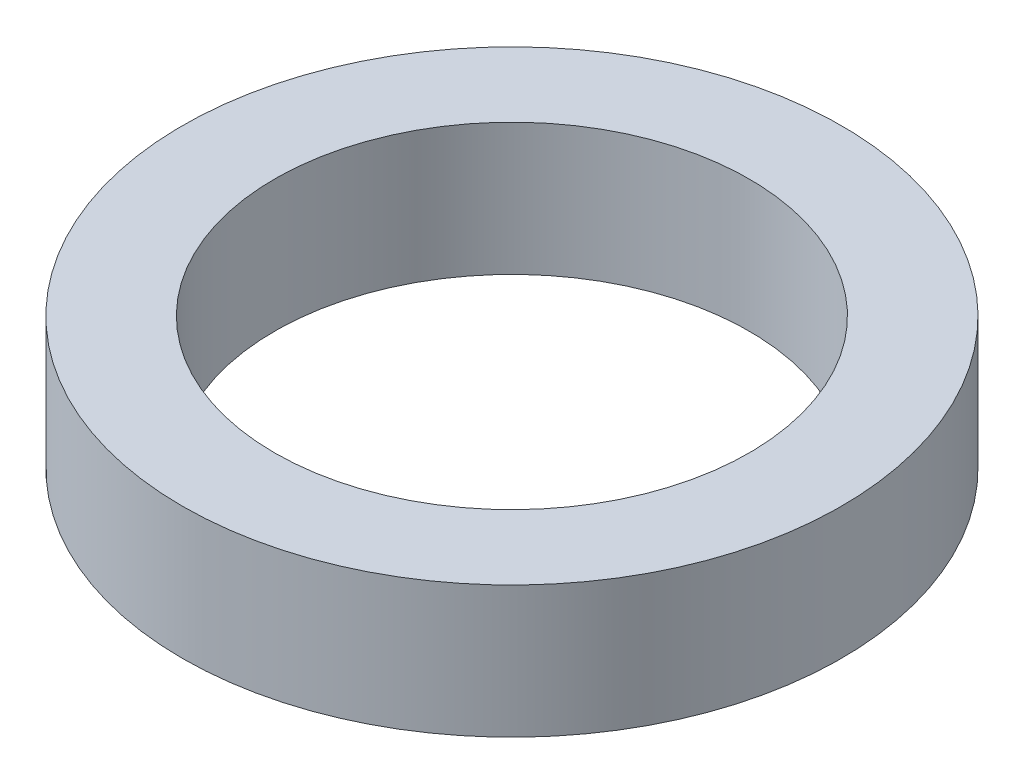
ISO-10303-21;
HEADER;
FILE_DESCRIPTION(('STEP AP214'),'2;1');
FILE_NAME('part.step','',(''),(''),'','','');
FILE_SCHEMA(('AUTOMOTIVE_DESIGN { 1 0 10303 214 1 1 1 1 }'));
ENDSEC;
DATA;
#1=APPLICATION_CONTEXT('core data for automotive mechanical design processes');
#2=APPLICATION_PROTOCOL_DEFINITION('international standard','automotive_design',2000,#1);
#3=PRODUCT_CONTEXT('',#1,'mechanical');
#4=PRODUCT('Part','Part','',(#3));
#5=PRODUCT_RELATED_PRODUCT_CATEGORY('part','',(#4));
#6=PRODUCT_DEFINITION_FORMATION('','',#4);
#7=PRODUCT_DEFINITION_CONTEXT('part definition',#1,'design');
#8=PRODUCT_DEFINITION('design','',#6,#7);
#9=PRODUCT_DEFINITION_SHAPE('','',#8);
#10=(LENGTH_UNIT() NAMED_UNIT(*) SI_UNIT(.MILLI.,.METRE.));
#11=(NAMED_UNIT(*) PLANE_ANGLE_UNIT() SI_UNIT($,.RADIAN.));
#12=(NAMED_UNIT(*) SI_UNIT($,.STERADIAN.) SOLID_ANGLE_UNIT());
#13=UNCERTAINTY_MEASURE_WITH_UNIT(LENGTH_MEASURE(1.E-05),#10,'distance_accuracy_value','');
#14=(GEOMETRIC_REPRESENTATION_CONTEXT(3) GLOBAL_UNCERTAINTY_ASSIGNED_CONTEXT((#13)) GLOBAL_UNIT_ASSIGNED_CONTEXT((#10,
#11,#12)) REPRESENTATION_CONTEXT('',''));
#15=CARTESIAN_POINT('',(0.,0.,0.));
#16=DIRECTION('',(0.,0.,1.));
#17=DIRECTION('',(1.,0.,0.));
#18=AXIS2_PLACEMENT_3D('',#15,#16,#17);
#19=CARTESIAN_POINT('',(0.,20.,0.));
#20=DIRECTION('',(0.,1.,0.));
#21=DIRECTION('',(0.,0.,1.));
#22=AXIS2_PLACEMENT_3D('',#19,#20,#21);
#23=PLANE('',#22);
#24=CARTESIAN_POINT('',(0.,20.,0.));
#25=DIRECTION('',(0.,1.,0.));
#26=DIRECTION('',(0.,0.,1.));
#27=AXIS2_PLACEMENT_3D('',#24,#25,#26);
#28=CIRCLE('',#27,36.);
#29=CARTESIAN_POINT('',(0.,20.,36.));
#30=VERTEX_POINT('',#29);
#31=EDGE_CURVE('E26',#30,#30,#28,.F.);
#32=ORIENTED_EDGE('',*,*,#31,.T.);
#33=EDGE_LOOP('',(#32));
#34=FACE_BOUND('',#33,.T.);
#35=CARTESIAN_POINT('',(0.,20.,0.));
#36=DIRECTION('',(0.,1.,0.));
#37=DIRECTION('',(0.,0.,1.));
#38=AXIS2_PLACEMENT_3D('',#35,#36,#37);
#39=CIRCLE('',#38,50.);
#40=CARTESIAN_POINT('',(0.,20.,50.));
#41=VERTEX_POINT('',#40);
#42=EDGE_CURVE('E17',#41,#41,#39,.F.);
#43=ORIENTED_EDGE('',*,*,#42,.F.);
#44=EDGE_LOOP('',(#43));
#45=FACE_BOUND('',#44,.T.);
#46=ADVANCED_FACE('F14',(#34,#45),#23,.T.);
#47=CARTESIAN_POINT('',(0.,0.,0.));
#48=DIRECTION('',(0.,1.,0.));
#49=DIRECTION('',(0.,0.,1.));
#50=AXIS2_PLACEMENT_3D('',#47,#48,#49);
#51=CYLINDRICAL_SURFACE('',#50,50.);
#52=ORIENTED_EDGE('',*,*,#42,.T.);
#53=EDGE_LOOP('',(#52));
#54=FACE_BOUND('',#53,.T.);
#55=CARTESIAN_POINT('',(0.,0.,0.));
#56=DIRECTION('',(0.,1.,0.));
#57=DIRECTION('',(0.,0.,1.));
#58=AXIS2_PLACEMENT_3D('',#55,#56,#57);
#59=CIRCLE('',#58,50.);
#60=CARTESIAN_POINT('',(0.,0.,50.));
#61=VERTEX_POINT('',#60);
#62=EDGE_CURVE('E21',#61,#61,#59,.T.);
#63=ORIENTED_EDGE('',*,*,#62,.T.);
#64=EDGE_LOOP('',(#63));
#65=FACE_BOUND('',#64,.T.);
#66=ADVANCED_FACE('F34',(#54,#65),#51,.T.);
#67=CARTESIAN_POINT('',(0.,0.,0.));
#68=DIRECTION('',(0.,1.,0.));
#69=DIRECTION('',(0.,0.,1.));
#70=AXIS2_PLACEMENT_3D('',#67,#68,#69);
#71=CYLINDRICAL_SURFACE('',#70,36.);
#72=ORIENTED_EDGE('',*,*,#31,.F.);
#73=EDGE_LOOP('',(#72));
#74=FACE_BOUND('',#73,.T.);
#75=CARTESIAN_POINT('',(0.,0.,0.));
#76=DIRECTION('',(0.,1.,0.));
#77=DIRECTION('',(0.,0.,1.));
#78=AXIS2_PLACEMENT_3D('',#75,#76,#77);
#79=CIRCLE('',#78,36.);
#80=CARTESIAN_POINT('',(0.,0.,36.));
#81=VERTEX_POINT('',#80);
#82=EDGE_CURVE('E10',#81,#81,#79,.F.);
#83=ORIENTED_EDGE('',*,*,#82,.T.);
#84=EDGE_LOOP('',(#83));
#85=FACE_BOUND('',#84,.T.);
#86=ADVANCED_FACE('F42',(#74,#85),#71,.F.);
#87=CARTESIAN_POINT('',(0.,0.,0.));
#88=DIRECTION('',(0.,1.,0.));
#89=DIRECTION('',(0.,0.,1.));
#90=AXIS2_PLACEMENT_3D('',#87,#88,#89);
#91=PLANE('',#90);
#92=ORIENTED_EDGE('',*,*,#82,.F.);
#93=EDGE_LOOP('',(#92));
#94=FACE_BOUND('',#93,.T.);
#95=ORIENTED_EDGE('',*,*,#62,.F.);
#96=EDGE_LOOP('',(#95));
#97=FACE_BOUND('',#96,.T.);
#98=ADVANCED_FACE('F43',(#94,#97),#91,.F.);
#99=CLOSED_SHELL('',(#46,#66,#86,#98));
#100=MANIFOLD_SOLID_BREP('B1',#99);
#101=ADVANCED_BREP_SHAPE_REPRESENTATION('',(#18,#100),#14);
#102=SHAPE_DEFINITION_REPRESENTATION(#9,#101);
ENDSEC;
END-ISO-10303-21;
